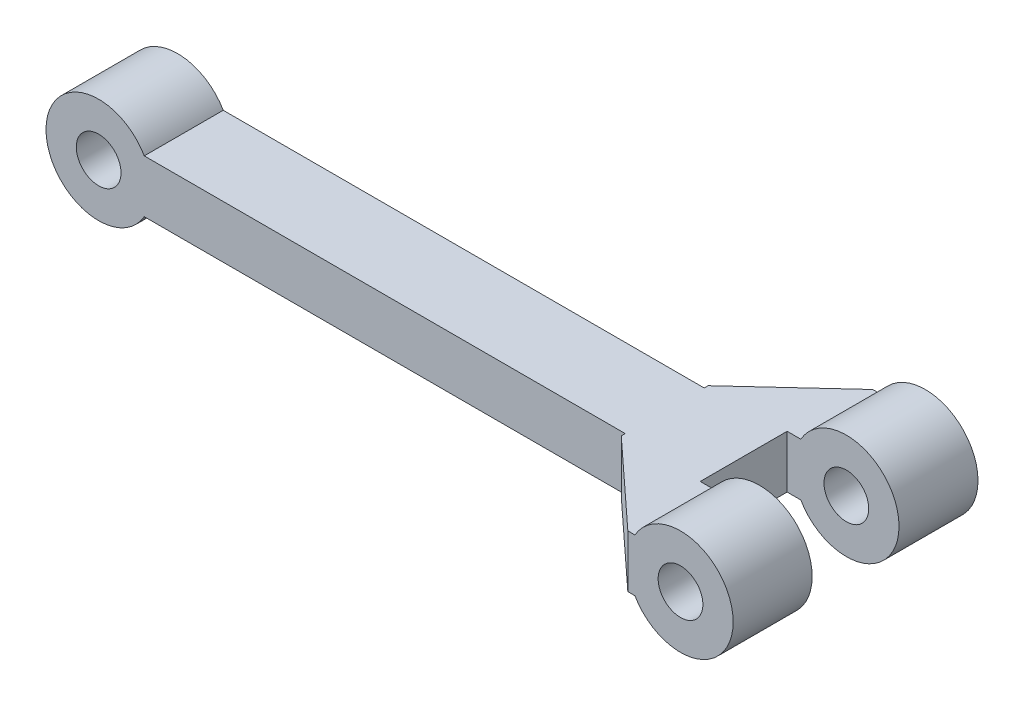
ISO-10303-21;
HEADER;
FILE_DESCRIPTION(('STEP AP214'),'2;1');
FILE_NAME('part.step','',(''),(''),'','','');
FILE_SCHEMA(('AUTOMOTIVE_DESIGN { 1 0 10303 214 1 1 1 1 }'));
ENDSEC;
DATA;
#1=APPLICATION_CONTEXT('core data for automotive mechanical design processes');
#2=APPLICATION_PROTOCOL_DEFINITION('international standard','automotive_design',2000,#1);
#3=PRODUCT_CONTEXT('',#1,'mechanical');
#4=PRODUCT('Part','Part','',(#3));
#5=PRODUCT_RELATED_PRODUCT_CATEGORY('part','',(#4));
#6=PRODUCT_DEFINITION_FORMATION('','',#4);
#7=PRODUCT_DEFINITION_CONTEXT('part definition',#1,'design');
#8=PRODUCT_DEFINITION('design','',#6,#7);
#9=PRODUCT_DEFINITION_SHAPE('','',#8);
#10=(LENGTH_UNIT() NAMED_UNIT(*) SI_UNIT(.MILLI.,.METRE.));
#11=(NAMED_UNIT(*) PLANE_ANGLE_UNIT() SI_UNIT($,.RADIAN.));
#12=(NAMED_UNIT(*) SI_UNIT($,.STERADIAN.) SOLID_ANGLE_UNIT());
#13=UNCERTAINTY_MEASURE_WITH_UNIT(LENGTH_MEASURE(1.E-05),#10,'distance_accuracy_value','');
#14=(GEOMETRIC_REPRESENTATION_CONTEXT(3) GLOBAL_UNCERTAINTY_ASSIGNED_CONTEXT((#13)) GLOBAL_UNIT_ASSIGNED_CONTEXT((#10,
#11,#12)) REPRESENTATION_CONTEXT('',''));
#15=CARTESIAN_POINT('',(0.,0.,0.));
#16=DIRECTION('',(0.,0.,1.));
#17=DIRECTION('',(1.,0.,0.));
#18=AXIS2_PLACEMENT_3D('',#15,#16,#17);
#19=CARTESIAN_POINT('',(-10.5,-2.,6.));
#20=DIRECTION('',(-1.,0.,0.));
#21=DIRECTION('',(0.,0.,1.));
#22=AXIS2_PLACEMENT_3D('',#19,#20,#21);
#23=PLANE('',#22);
#24=DIRECTION('',(0.,0.,1.));
#25=VECTOR('',#24,1.);
#26=CARTESIAN_POINT('',(-10.5,2.,6.));
#27=LINE('',#26,#25);
#28=CARTESIAN_POINT('',(-10.5,2.,12.3));
#29=VERTEX_POINT('',#28);
#30=CARTESIAN_POINT('',(-10.5,2.,12.6));
#31=VERTEX_POINT('',#30);
#32=EDGE_CURVE('E260',#29,#31,#27,.T.);
#33=ORIENTED_EDGE('',*,*,#32,.F.);
#34=DIRECTION('',(0.,-1.,0.));
#35=VECTOR('',#34,1.);
#36=CARTESIAN_POINT('',(-10.5,2.,12.3));
#37=LINE('',#36,#35);
#38=CARTESIAN_POINT('',(-10.5,-2.,12.3));
#39=VERTEX_POINT('',#38);
#40=EDGE_CURVE('E326',#29,#39,#37,.T.);
#41=ORIENTED_EDGE('',*,*,#40,.T.);
#42=DIRECTION('',(0.,0.,1.));
#43=VECTOR('',#42,1.);
#44=CARTESIAN_POINT('',(-10.5,-2.,6.));
#45=LINE('',#44,#43);
#46=CARTESIAN_POINT('',(-10.5,-2.,12.6));
#47=VERTEX_POINT('',#46);
#48=EDGE_CURVE('E177',#39,#47,#45,.T.);
#49=ORIENTED_EDGE('',*,*,#48,.T.);
#50=DIRECTION('',(0.,1.,0.));
#51=VECTOR('',#50,1.);
#52=CARTESIAN_POINT('',(-10.5,-2.,12.6));
#53=LINE('',#52,#51);
#54=EDGE_CURVE('E214',#47,#31,#53,.T.);
#55=ORIENTED_EDGE('',*,*,#54,.T.);
#56=EDGE_LOOP('',(#33,#41,#49,#55));
#57=FACE_BOUND('',#56,.T.);
#58=ADVANCED_FACE('F45',(#57),#23,.T.);
#59=CARTESIAN_POINT('',(0.,0.,6.));
#60=DIRECTION('',(0.,0.,1.));
#61=DIRECTION('',(1.,0.,0.));
#62=AXIS2_PLACEMENT_3D('',#59,#60,#61);
#63=PLANE('',#62);
#64=DIRECTION('',(1.,0.,0.));
#65=VECTOR('',#64,1.);
#66=CARTESIAN_POINT('',(-4.5,-2.,6.));
#67=LINE('',#66,#65);
#68=CARTESIAN_POINT('',(-4.5,-2.,6.));
#69=VERTEX_POINT('',#68);
#70=CARTESIAN_POINT('',(-3.46410161513775,-2.,6.));
#71=VERTEX_POINT('',#70);
#72=EDGE_CURVE('E198',#69,#71,#67,.T.);
#73=ORIENTED_EDGE('',*,*,#72,.T.);
#74=CARTESIAN_POINT('',(0.,0.,6.));
#75=DIRECTION('',(0.,0.,1.));
#76=DIRECTION('',(1.,0.,0.));
#77=AXIS2_PLACEMENT_3D('',#74,#75,#76);
#78=CIRCLE('',#77,4.);
#79=CARTESIAN_POINT('',(-3.46410161513775,2.,6.));
#80=VERTEX_POINT('',#79);
#81=EDGE_CURVE('E230',#71,#80,#78,.T.);
#82=ORIENTED_EDGE('',*,*,#81,.T.);
#83=DIRECTION('',(1.,0.,0.));
#84=VECTOR('',#83,1.);
#85=CARTESIAN_POINT('',(-4.5,2.,6.));
#86=LINE('',#85,#84);
#87=CARTESIAN_POINT('',(-4.5,2.,6.));
#88=VERTEX_POINT('',#87);
#89=EDGE_CURVE('E248',#88,#80,#86,.T.);
#90=ORIENTED_EDGE('',*,*,#89,.F.);
#91=DIRECTION('',(0.,1.,0.));
#92=VECTOR('',#91,1.);
#93=CARTESIAN_POINT('',(-4.5,-2.,6.));
#94=LINE('',#93,#92);
#95=EDGE_CURVE('E203',#69,#88,#94,.T.);
#96=ORIENTED_EDGE('',*,*,#95,.F.);
#97=EDGE_LOOP('',(#73,#82,#90,#96));
#98=FACE_BOUND('',#97,.T.);
#99=CARTESIAN_POINT('',(0.,0.,6.));
#100=DIRECTION('',(0.,0.,1.));
#101=DIRECTION('',(1.,0.,0.));
#102=AXIS2_PLACEMENT_3D('',#99,#100,#101);
#103=CIRCLE('',#102,1.7);
#104=CARTESIAN_POINT('',(1.7,0.,6.));
#105=VERTEX_POINT('',#104);
#106=EDGE_CURVE('E222',#105,#105,#103,.T.);
#107=ORIENTED_EDGE('',*,*,#106,.F.);
#108=EDGE_LOOP('',(#107));
#109=FACE_BOUND('',#108,.T.);
#110=ADVANCED_FACE('F291',(#98,#109),#63,.T.);
#111=CARTESIAN_POINT('',(0.,0.,0.));
#112=DIRECTION('',(0.,0.,1.));
#113=DIRECTION('',(1.,0.,0.));
#114=AXIS2_PLACEMENT_3D('',#111,#112,#113);
#115=PLANE('',#114);
#116=CARTESIAN_POINT('',(0.,0.,0.));
#117=DIRECTION('',(0.,0.,1.));
#118=DIRECTION('',(1.,0.,0.));
#119=AXIS2_PLACEMENT_3D('',#116,#117,#118);
#120=CIRCLE('',#119,4.);
#121=CARTESIAN_POINT('',(-3.46410161513775,-2.,0.));
#122=VERTEX_POINT('',#121);
#123=CARTESIAN_POINT('',(-3.46410161513775,2.,0.));
#124=VERTEX_POINT('',#123);
#125=EDGE_CURVE('E226',#122,#124,#120,.T.);
#126=ORIENTED_EDGE('',*,*,#125,.F.);
#127=DIRECTION('',(-1.,0.,0.));
#128=VECTOR('',#127,1.);
#129=CARTESIAN_POINT('',(-4.,-2.,0.));
#130=LINE('',#129,#128);
#131=CARTESIAN_POINT('',(-4.,-2.,0.));
#132=VERTEX_POINT('',#131);
#133=EDGE_CURVE('E283',#122,#132,#130,.T.);
#134=ORIENTED_EDGE('',*,*,#133,.T.);
#135=DIRECTION('',(0.,1.,0.));
#136=VECTOR('',#135,1.);
#137=CARTESIAN_POINT('',(-4.,-2.,0.));
#138=LINE('',#137,#136);
#139=CARTESIAN_POINT('',(-4.,2.,0.));
#140=VERTEX_POINT('',#139);
#141=EDGE_CURVE('E202',#132,#140,#138,.T.);
#142=ORIENTED_EDGE('',*,*,#141,.T.);
#143=DIRECTION('',(-1.,0.,0.));
#144=VECTOR('',#143,1.);
#145=CARTESIAN_POINT('',(-4.,2.,0.));
#146=LINE('',#145,#144);
#147=EDGE_CURVE('E244',#124,#140,#146,.T.);
#148=ORIENTED_EDGE('',*,*,#147,.F.);
#149=EDGE_LOOP('',(#126,#134,#142,#148));
#150=FACE_BOUND('',#149,.T.);
#151=CARTESIAN_POINT('',(0.,0.,0.));
#152=DIRECTION('',(0.,0.,1.));
#153=DIRECTION('',(1.,0.,0.));
#154=AXIS2_PLACEMENT_3D('',#151,#152,#153);
#155=CIRCLE('',#154,1.7);
#156=CARTESIAN_POINT('',(1.7,0.,0.));
#157=VERTEX_POINT('',#156);
#158=EDGE_CURVE('E206',#157,#157,#155,.T.);
#159=ORIENTED_EDGE('',*,*,#158,.T.);
#160=EDGE_LOOP('',(#159));
#161=FACE_BOUND('',#160,.T.);
#162=ADVANCED_FACE('F250',(#150,#161),#115,.F.);
#163=CARTESIAN_POINT('',(0.,0.,6.));
#164=DIRECTION('',(0.,0.,-1.));
#165=DIRECTION('',(-1.,0.,0.));
#166=AXIS2_PLACEMENT_3D('',#163,#164,#165);
#167=CYLINDRICAL_SURFACE('',#166,4.);
#168=ORIENTED_EDGE('',*,*,#81,.F.);
#169=DIRECTION('',(0.,0.,-1.));
#170=VECTOR('',#169,1.);
#171=CARTESIAN_POINT('',(-3.46410161513775,-2.,6.));
#172=LINE('',#171,#170);
#173=EDGE_CURVE('E11',#71,#122,#172,.T.);
#174=ORIENTED_EDGE('',*,*,#173,.T.);
#175=ORIENTED_EDGE('',*,*,#125,.T.);
#176=DIRECTION('',(0.,0.,-1.));
#177=VECTOR('',#176,1.);
#178=CARTESIAN_POINT('',(-3.46410161513775,2.,6.));
#179=LINE('',#178,#177);
#180=EDGE_CURVE('E54',#80,#124,#179,.T.);
#181=ORIENTED_EDGE('',*,*,#180,.F.);
#182=EDGE_LOOP('',(#168,#174,#175,#181));
#183=FACE_BOUND('',#182,.T.);
#184=ADVANCED_FACE('F47',(#183),#167,.T.);
#185=CARTESIAN_POINT('',(0.,0.,6.));
#186=DIRECTION('',(0.,0.,-1.));
#187=DIRECTION('',(-1.,0.,0.));
#188=AXIS2_PLACEMENT_3D('',#185,#186,#187);
#189=CYLINDRICAL_SURFACE('',#188,1.7);
#190=ORIENTED_EDGE('',*,*,#106,.T.);
#191=EDGE_LOOP('',(#190));
#192=FACE_BOUND('',#191,.T.);
#193=ORIENTED_EDGE('',*,*,#158,.F.);
#194=EDGE_LOOP('',(#193));
#195=FACE_BOUND('',#194,.T.);
#196=ADVANCED_FACE('F392',(#192,#195),#189,.F.);
#197=CARTESIAN_POINT('',(0.,-2.,0.));
#198=DIRECTION('',(0.,-1.,0.));
#199=DIRECTION('',(0.,0.,-1.));
#200=AXIS2_PLACEMENT_3D('',#197,#198,#199);
#201=PLANE('',#200);
#202=DIRECTION('',(0.,0.,1.));
#203=VECTOR('',#202,1.);
#204=CARTESIAN_POINT('',(-3.46410161513775,-2.,12.6));
#205=LINE('',#204,#203);
#206=CARTESIAN_POINT('',(-3.46410161513775,-2.,18.6));
#207=VERTEX_POINT('',#206);
#208=CARTESIAN_POINT('',(-3.46410161513775,-2.,12.6));
#209=VERTEX_POINT('',#208);
#210=EDGE_CURVE('E256',#207,#209,#205,.F.);
#211=ORIENTED_EDGE('',*,*,#210,.F.);
#212=DIRECTION('',(1.,0.,0.));
#213=VECTOR('',#212,1.);
#214=CARTESIAN_POINT('',(-3.,-2.,18.6));
#215=LINE('',#214,#213);
#216=CARTESIAN_POINT('',(-4.,-2.,18.6));
#217=VERTEX_POINT('',#216);
#218=EDGE_CURVE('E182',#217,#207,#215,.T.);
#219=ORIENTED_EDGE('',*,*,#218,.F.);
#220=DIRECTION('',(0.734803444627488,0.,0.678280102733065));
#221=VECTOR('',#220,1.);
#222=CARTESIAN_POINT('',(-10.5,-2.,12.6));
#223=LINE('',#222,#221);
#224=EDGE_CURVE('E176',#47,#217,#223,.T.);
#225=ORIENTED_EDGE('',*,*,#224,.F.);
#226=ORIENTED_EDGE('',*,*,#48,.F.);
#227=DIRECTION('',(-1.,0.,0.));
#228=VECTOR('',#227,1.);
#229=CARTESIAN_POINT('',(-10.5,-2.,12.3));
#230=LINE('',#229,#228);
#231=CARTESIAN_POINT('',(-47.0358983848622,-2.,12.3));
#232=VERTEX_POINT('',#231);
#233=EDGE_CURVE('E61',#39,#232,#230,.T.);
#234=ORIENTED_EDGE('',*,*,#233,.T.);
#235=DIRECTION('',(0.,0.,-1.));
#236=VECTOR('',#235,1.);
#237=CARTESIAN_POINT('',(-47.0358983848622,-2.,12.3));
#238=LINE('',#237,#236);
#239=CARTESIAN_POINT('',(-47.0358983848622,-2.,6.3));
#240=VERTEX_POINT('',#239);
#241=EDGE_CURVE('E154',#232,#240,#238,.T.);
#242=ORIENTED_EDGE('',*,*,#241,.T.);
#243=DIRECTION('',(-1.,0.,0.));
#244=VECTOR('',#243,1.);
#245=CARTESIAN_POINT('',(-10.5,-2.,6.3));
#246=LINE('',#245,#244);
#247=CARTESIAN_POINT('',(-10.5,-2.,6.3));
#248=VERTEX_POINT('',#247);
#249=EDGE_CURVE('E146',#248,#240,#246,.T.);
#250=ORIENTED_EDGE('',*,*,#249,.F.);
#251=CARTESIAN_POINT('',(-10.5,-2.,6.));
#252=VERTEX_POINT('',#251);
#253=EDGE_CURVE('E152',#252,#248,#45,.T.);
#254=ORIENTED_EDGE('',*,*,#253,.F.);
#255=DIRECTION('',(-0.734803444627488,0.,0.678280102733066));
#256=VECTOR('',#255,1.);
#257=CARTESIAN_POINT('',(-4.,-2.,0.));
#258=LINE('',#257,#256);
#259=EDGE_CURVE('E184',#132,#252,#258,.T.);
#260=ORIENTED_EDGE('',*,*,#259,.F.);
#261=ORIENTED_EDGE('',*,*,#133,.F.);
#262=ORIENTED_EDGE('',*,*,#173,.F.);
#263=ORIENTED_EDGE('',*,*,#72,.F.);
#264=DIRECTION('',(0.,0.,-1.));
#265=VECTOR('',#264,1.);
#266=CARTESIAN_POINT('',(-4.5,-2.,12.6));
#267=LINE('',#266,#265);
#268=CARTESIAN_POINT('',(-4.5,-2.,12.6));
#269=VERTEX_POINT('',#268);
#270=EDGE_CURVE('E194',#269,#69,#267,.T.);
#271=ORIENTED_EDGE('',*,*,#270,.F.);
#272=DIRECTION('',(-1.,0.,0.));
#273=VECTOR('',#272,1.);
#274=CARTESIAN_POINT('',(-4.,-2.,12.6));
#275=LINE('',#274,#273);
#276=EDGE_CURVE('E191',#209,#269,#275,.T.);
#277=ORIENTED_EDGE('',*,*,#276,.F.);
#278=EDGE_LOOP('',(#211,#219,#225,#226,#234,#242,#250,#254,#260,#261,#262,#263,#271,#277));
#279=FACE_BOUND('',#278,.T.);
#280=ADVANCED_FACE('F149',(#279),#201,.T.);
#281=CARTESIAN_POINT('',(0.,2.,0.));
#282=DIRECTION('',(0.,-1.,0.));
#283=DIRECTION('',(0.,0.,-1.));
#284=AXIS2_PLACEMENT_3D('',#281,#282,#283);
#285=PLANE('',#284);
#286=DIRECTION('',(1.,0.,0.));
#287=VECTOR('',#286,1.);
#288=CARTESIAN_POINT('',(-3.,2.,18.6));
#289=LINE('',#288,#287);
#290=CARTESIAN_POINT('',(-4.,2.,18.6));
#291=VERTEX_POINT('',#290);
#292=CARTESIAN_POINT('',(-3.46410161513775,2.,18.6));
#293=VERTEX_POINT('',#292);
#294=EDGE_CURVE('E273',#291,#293,#289,.T.);
#295=ORIENTED_EDGE('',*,*,#294,.T.);
#296=DIRECTION('',(0.,0.,1.));
#297=VECTOR('',#296,1.);
#298=CARTESIAN_POINT('',(-3.46410161513775,2.,12.6));
#299=LINE('',#298,#297);
#300=CARTESIAN_POINT('',(-3.46410161513775,2.,12.6));
#301=VERTEX_POINT('',#300);
#302=EDGE_CURVE('E262',#293,#301,#299,.F.);
#303=ORIENTED_EDGE('',*,*,#302,.T.);
#304=DIRECTION('',(-1.,0.,0.));
#305=VECTOR('',#304,1.);
#306=CARTESIAN_POINT('',(-4.,2.,12.6));
#307=LINE('',#306,#305);
#308=CARTESIAN_POINT('',(-4.5,2.,12.6));
#309=VERTEX_POINT('',#308);
#310=EDGE_CURVE('E276',#301,#309,#307,.T.);
#311=ORIENTED_EDGE('',*,*,#310,.T.);
#312=DIRECTION('',(0.,0.,-1.));
#313=VECTOR('',#312,1.);
#314=CARTESIAN_POINT('',(-4.5,2.,12.6));
#315=LINE('',#314,#313);
#316=EDGE_CURVE('E279',#309,#88,#315,.T.);
#317=ORIENTED_EDGE('',*,*,#316,.T.);
#318=ORIENTED_EDGE('',*,*,#89,.T.);
#319=ORIENTED_EDGE('',*,*,#180,.T.);
#320=ORIENTED_EDGE('',*,*,#147,.T.);
#321=DIRECTION('',(-0.734803444627488,0.,0.678280102733066));
#322=VECTOR('',#321,1.);
#323=CARTESIAN_POINT('',(-4.,2.,0.));
#324=LINE('',#323,#322);
#325=CARTESIAN_POINT('',(-10.5,2.,6.));
#326=VERTEX_POINT('',#325);
#327=EDGE_CURVE('E255',#140,#326,#324,.T.);
#328=ORIENTED_EDGE('',*,*,#327,.T.);
#329=CARTESIAN_POINT('',(-10.5,2.,6.3));
#330=VERTEX_POINT('',#329);
#331=EDGE_CURVE('E266',#326,#330,#27,.T.);
#332=ORIENTED_EDGE('',*,*,#331,.T.);
#333=DIRECTION('',(1.,0.,0.));
#334=VECTOR('',#333,1.);
#335=CARTESIAN_POINT('',(-10.5,2.,6.3));
#336=LINE('',#335,#334);
#337=CARTESIAN_POINT('',(-47.0358983848622,2.,6.3));
#338=VERTEX_POINT('',#337);
#339=EDGE_CURVE('E166',#338,#330,#336,.T.);
#340=ORIENTED_EDGE('',*,*,#339,.F.);
#341=DIRECTION('',(0.,0.,-1.));
#342=VECTOR('',#341,1.);
#343=CARTESIAN_POINT('',(-47.0358983848622,2.,12.3));
#344=LINE('',#343,#342);
#345=CARTESIAN_POINT('',(-47.0358983848622,2.,12.3));
#346=VERTEX_POINT('',#345);
#347=EDGE_CURVE('E338',#346,#338,#344,.T.);
#348=ORIENTED_EDGE('',*,*,#347,.F.);
#349=DIRECTION('',(1.,0.,0.));
#350=VECTOR('',#349,1.);
#351=CARTESIAN_POINT('',(-10.5,2.,12.3));
#352=LINE('',#351,#350);
#353=EDGE_CURVE('E320',#346,#29,#352,.T.);
#354=ORIENTED_EDGE('',*,*,#353,.T.);
#355=ORIENTED_EDGE('',*,*,#32,.T.);
#356=DIRECTION('',(0.734803444627488,0.,0.678280102733065));
#357=VECTOR('',#356,1.);
#358=CARTESIAN_POINT('',(-10.5,2.,12.6));
#359=LINE('',#358,#357);
#360=EDGE_CURVE('E269',#31,#291,#359,.T.);
#361=ORIENTED_EDGE('',*,*,#360,.T.);
#362=EDGE_LOOP('',(#295,#303,#311,#317,#318,#319,#320,#328,#332,#340,#348,#354,#355,#361));
#363=FACE_BOUND('',#362,.T.);
#364=ADVANCED_FACE('F242',(#363),#285,.F.);
#365=CARTESIAN_POINT('',(-4.5,-2.,12.6));
#366=DIRECTION('',(1.,0.,0.));
#367=DIRECTION('',(0.,0.,-1.));
#368=AXIS2_PLACEMENT_3D('',#365,#366,#367);
#369=PLANE('',#368);
#370=ORIENTED_EDGE('',*,*,#95,.T.);
#371=ORIENTED_EDGE('',*,*,#316,.F.);
#372=DIRECTION('',(0.,1.,0.));
#373=VECTOR('',#372,1.);
#374=CARTESIAN_POINT('',(-4.5,-2.,12.6));
#375=LINE('',#374,#373);
#376=EDGE_CURVE('E207',#269,#309,#375,.T.);
#377=ORIENTED_EDGE('',*,*,#376,.F.);
#378=ORIENTED_EDGE('',*,*,#270,.T.);
#379=EDGE_LOOP('',(#370,#371,#377,#378));
#380=FACE_BOUND('',#379,.T.);
#381=ADVANCED_FACE('F295',(#380),#369,.T.);
#382=CARTESIAN_POINT('',(-4.,-2.,12.6));
#383=DIRECTION('',(0.,0.,-1.));
#384=DIRECTION('',(-1.,0.,0.));
#385=AXIS2_PLACEMENT_3D('',#382,#383,#384);
#386=PLANE('',#385);
#387=CARTESIAN_POINT('',(0.,0.,12.6));
#388=DIRECTION('',(0.,0.,1.));
#389=DIRECTION('',(1.,0.,0.));
#390=AXIS2_PLACEMENT_3D('',#387,#388,#389);
#391=CIRCLE('',#390,4.);
#392=EDGE_CURVE('E351',#209,#301,#391,.T.);
#393=ORIENTED_EDGE('',*,*,#392,.F.);
#394=ORIENTED_EDGE('',*,*,#276,.T.);
#395=ORIENTED_EDGE('',*,*,#376,.T.);
#396=ORIENTED_EDGE('',*,*,#310,.F.);
#397=EDGE_LOOP('',(#393,#394,#395,#396));
#398=FACE_BOUND('',#397,.T.);
#399=CARTESIAN_POINT('',(0.,0.,12.6));
#400=DIRECTION('',(0.,0.,1.));
#401=DIRECTION('',(1.,0.,0.));
#402=AXIS2_PLACEMENT_3D('',#399,#400,#401);
#403=CIRCLE('',#402,1.7);
#404=CARTESIAN_POINT('',(1.7,0.,12.6));
#405=VERTEX_POINT('',#404);
#406=EDGE_CURVE('E344',#405,#405,#403,.T.);
#407=ORIENTED_EDGE('',*,*,#406,.T.);
#408=EDGE_LOOP('',(#407));
#409=FACE_BOUND('',#408,.T.);
#410=ADVANCED_FACE('F301',(#398,#409),#386,.T.);
#411=CARTESIAN_POINT('',(-3.,-2.,18.6));
#412=DIRECTION('',(0.,0.,1.));
#413=DIRECTION('',(1.,0.,0.));
#414=AXIS2_PLACEMENT_3D('',#411,#412,#413);
#415=PLANE('',#414);
#416=ORIENTED_EDGE('',*,*,#218,.T.);
#417=CARTESIAN_POINT('',(0.,0.,18.6));
#418=DIRECTION('',(0.,0.,1.));
#419=DIRECTION('',(1.,0.,0.));
#420=AXIS2_PLACEMENT_3D('',#417,#418,#419);
#421=CIRCLE('',#420,4.);
#422=EDGE_CURVE('E312',#207,#293,#421,.T.);
#423=ORIENTED_EDGE('',*,*,#422,.T.);
#424=ORIENTED_EDGE('',*,*,#294,.F.);
#425=DIRECTION('',(0.,1.,0.));
#426=VECTOR('',#425,1.);
#427=CARTESIAN_POINT('',(-4.,-2.,18.6));
#428=LINE('',#427,#426);
#429=EDGE_CURVE('E211',#217,#291,#428,.T.);
#430=ORIENTED_EDGE('',*,*,#429,.F.);
#431=EDGE_LOOP('',(#416,#423,#424,#430));
#432=FACE_BOUND('',#431,.T.);
#433=CARTESIAN_POINT('',(0.,0.,18.6));
#434=DIRECTION('',(0.,0.,1.));
#435=DIRECTION('',(1.,0.,0.));
#436=AXIS2_PLACEMENT_3D('',#433,#434,#435);
#437=CIRCLE('',#436,1.7);
#438=CARTESIAN_POINT('',(1.7,0.,18.6));
#439=VERTEX_POINT('',#438);
#440=EDGE_CURVE('E341',#439,#439,#437,.T.);
#441=ORIENTED_EDGE('',*,*,#440,.F.);
#442=EDGE_LOOP('',(#441));
#443=FACE_BOUND('',#442,.T.);
#444=ADVANCED_FACE('F309',(#432,#443),#415,.T.);
#445=CARTESIAN_POINT('',(-10.5,-2.,12.6));
#446=DIRECTION('',(-0.678280102733065,0.,0.734803444627488));
#447=DIRECTION('',(0.734803444627488,0.,0.678280102733065));
#448=AXIS2_PLACEMENT_3D('',#445,#446,#447);
#449=PLANE('',#448);
#450=ORIENTED_EDGE('',*,*,#429,.T.);
#451=ORIENTED_EDGE('',*,*,#360,.F.);
#452=ORIENTED_EDGE('',*,*,#54,.F.);
#453=ORIENTED_EDGE('',*,*,#224,.T.);
#454=EDGE_LOOP('',(#450,#451,#452,#453));
#455=FACE_BOUND('',#454,.T.);
#456=ADVANCED_FACE('F315',(#455),#449,.T.);
#457=DIRECTION('',(0.,-1.,0.));
#458=VECTOR('',#457,1.);
#459=CARTESIAN_POINT('',(-10.5,2.,6.3));
#460=LINE('',#459,#458);
#461=EDGE_CURVE('E160',#330,#248,#460,.T.);
#462=ORIENTED_EDGE('',*,*,#461,.F.);
#463=ORIENTED_EDGE('',*,*,#331,.F.);
#464=DIRECTION('',(0.,1.,0.));
#465=VECTOR('',#464,1.);
#466=CARTESIAN_POINT('',(-10.5,-2.,6.));
#467=LINE('',#466,#465);
#468=EDGE_CURVE('E174',#252,#326,#467,.T.);
#469=ORIENTED_EDGE('',*,*,#468,.F.);
#470=ORIENTED_EDGE('',*,*,#253,.T.);
#471=EDGE_LOOP('',(#462,#463,#469,#470));
#472=FACE_BOUND('',#471,.T.);
#473=ADVANCED_FACE('F173',(#472),#23,.T.);
#474=CARTESIAN_POINT('',(-4.,-2.,0.));
#475=DIRECTION('',(-0.678280102733066,0.,-0.734803444627488));
#476=DIRECTION('',(-0.734803444627488,0.,0.678280102733066));
#477=AXIS2_PLACEMENT_3D('',#474,#475,#476);
#478=PLANE('',#477);
#479=ORIENTED_EDGE('',*,*,#468,.T.);
#480=ORIENTED_EDGE('',*,*,#327,.F.);
#481=ORIENTED_EDGE('',*,*,#141,.F.);
#482=ORIENTED_EDGE('',*,*,#259,.T.);
#483=EDGE_LOOP('',(#479,#480,#481,#482));
#484=FACE_BOUND('',#483,.T.);
#485=ADVANCED_FACE('F287',(#484),#478,.T.);
#486=CARTESIAN_POINT('',(0.,0.,12.6));
#487=DIRECTION('',(0.,0.,1.));
#488=DIRECTION('',(1.,0.,0.));
#489=AXIS2_PLACEMENT_3D('',#486,#487,#488);
#490=CYLINDRICAL_SURFACE('',#489,4.);
#491=ORIENTED_EDGE('',*,*,#422,.F.);
#492=ORIENTED_EDGE('',*,*,#210,.T.);
#493=ORIENTED_EDGE('',*,*,#392,.T.);
#494=ORIENTED_EDGE('',*,*,#302,.F.);
#495=EDGE_LOOP('',(#491,#492,#493,#494));
#496=FACE_BOUND('',#495,.T.);
#497=ADVANCED_FACE('F356',(#496),#490,.T.);
#498=CARTESIAN_POINT('',(0.,0.,12.6));
#499=DIRECTION('',(0.,0.,1.));
#500=DIRECTION('',(1.,0.,0.));
#501=AXIS2_PLACEMENT_3D('',#498,#499,#500);
#502=CYLINDRICAL_SURFACE('',#501,1.7);
#503=ORIENTED_EDGE('',*,*,#406,.F.);
#504=EDGE_LOOP('',(#503));
#505=FACE_BOUND('',#504,.T.);
#506=ORIENTED_EDGE('',*,*,#440,.T.);
#507=EDGE_LOOP('',(#506));
#508=FACE_BOUND('',#507,.T.);
#509=ADVANCED_FACE('F358',(#505,#508),#502,.F.);
#510=CARTESIAN_POINT('',(-50.5,0.,12.3));
#511=DIRECTION('',(0.,0.,-1.));
#512=DIRECTION('',(-1.,0.,0.));
#513=AXIS2_PLACEMENT_3D('',#510,#511,#512);
#514=CYLINDRICAL_SURFACE('',#513,4.);
#515=ORIENTED_EDGE('',*,*,#347,.T.);
#516=CARTESIAN_POINT('',(-50.5,0.,6.3));
#517=DIRECTION('',(0.,0.,-1.));
#518=DIRECTION('',(-1.,0.,0.));
#519=AXIS2_PLACEMENT_3D('',#516,#517,#518);
#520=CIRCLE('',#519,4.);
#521=EDGE_CURVE('E159',#240,#338,#520,.T.);
#522=ORIENTED_EDGE('',*,*,#521,.F.);
#523=ORIENTED_EDGE('',*,*,#241,.F.);
#524=CARTESIAN_POINT('',(-50.5,0.,12.3));
#525=DIRECTION('',(0.,0.,-1.));
#526=DIRECTION('',(-1.,0.,0.));
#527=AXIS2_PLACEMENT_3D('',#524,#525,#526);
#528=CIRCLE('',#527,4.);
#529=EDGE_CURVE('E325',#232,#346,#528,.T.);
#530=ORIENTED_EDGE('',*,*,#529,.T.);
#531=EDGE_LOOP('',(#515,#522,#523,#530));
#532=FACE_BOUND('',#531,.T.);
#533=ADVANCED_FACE('F364',(#532),#514,.T.);
#534=CARTESIAN_POINT('',(-50.5,0.,12.3));
#535=DIRECTION('',(0.,0.,-1.));
#536=DIRECTION('',(-1.,0.,0.));
#537=AXIS2_PLACEMENT_3D('',#534,#535,#536);
#538=PLANE('',#537);
#539=CARTESIAN_POINT('',(-50.5,0.,12.3));
#540=DIRECTION('',(0.,0.,-1.));
#541=DIRECTION('',(-1.,0.,0.));
#542=AXIS2_PLACEMENT_3D('',#539,#540,#541);
#543=CIRCLE('',#542,1.7);
#544=CARTESIAN_POINT('',(-52.2,0.,12.3));
#545=VERTEX_POINT('',#544);
#546=EDGE_CURVE('E332',#545,#545,#543,.T.);
#547=ORIENTED_EDGE('',*,*,#546,.T.);
#548=EDGE_LOOP('',(#547));
#549=FACE_BOUND('',#548,.T.);
#550=ORIENTED_EDGE('',*,*,#40,.F.);
#551=ORIENTED_EDGE('',*,*,#353,.F.);
#552=ORIENTED_EDGE('',*,*,#529,.F.);
#553=ORIENTED_EDGE('',*,*,#233,.F.);
#554=EDGE_LOOP('',(#550,#551,#552,#553));
#555=FACE_BOUND('',#554,.T.);
#556=ADVANCED_FACE('F511',(#549,#555),#538,.F.);
#557=CARTESIAN_POINT('',(-50.5,0.,12.3));
#558=DIRECTION('',(0.,0.,-1.));
#559=DIRECTION('',(-1.,0.,0.));
#560=AXIS2_PLACEMENT_3D('',#557,#558,#559);
#561=CYLINDRICAL_SURFACE('',#560,1.7);
#562=ORIENTED_EDGE('',*,*,#546,.F.);
#563=EDGE_LOOP('',(#562));
#564=FACE_BOUND('',#563,.T.);
#565=CARTESIAN_POINT('',(-50.5,0.,6.3));
#566=DIRECTION('',(0.,0.,-1.));
#567=DIRECTION('',(-1.,0.,0.));
#568=AXIS2_PLACEMENT_3D('',#565,#566,#567);
#569=CIRCLE('',#568,1.7);
#570=CARTESIAN_POINT('',(-52.2,0.,6.3));
#571=VERTEX_POINT('',#570);
#572=EDGE_CURVE('E171',#571,#571,#569,.T.);
#573=ORIENTED_EDGE('',*,*,#572,.T.);
#574=EDGE_LOOP('',(#573));
#575=FACE_BOUND('',#574,.T.);
#576=ADVANCED_FACE('F520',(#564,#575),#561,.F.);
#577=CARTESIAN_POINT('',(-50.5,0.,6.3));
#578=DIRECTION('',(0.,0.,-1.));
#579=DIRECTION('',(-1.,0.,0.));
#580=AXIS2_PLACEMENT_3D('',#577,#578,#579);
#581=PLANE('',#580);
#582=ORIENTED_EDGE('',*,*,#461,.T.);
#583=ORIENTED_EDGE('',*,*,#249,.T.);
#584=ORIENTED_EDGE('',*,*,#521,.T.);
#585=ORIENTED_EDGE('',*,*,#339,.T.);
#586=EDGE_LOOP('',(#582,#583,#584,#585));
#587=FACE_BOUND('',#586,.T.);
#588=ORIENTED_EDGE('',*,*,#572,.F.);
#589=EDGE_LOOP('',(#588));
#590=FACE_BOUND('',#589,.T.);
#591=ADVANCED_FACE('F163',(#587,#590),#581,.T.);
#592=CLOSED_SHELL('',(#58,#110,#162,#184,#196,#280,#364,#381,#410,#444,#456,#473,#485,#497,#509,
#533,#556,#576,#591));
#593=MANIFOLD_SOLID_BREP('B2',#592);
#594=ADVANCED_BREP_SHAPE_REPRESENTATION('',(#18,#593),#14);
#595=SHAPE_DEFINITION_REPRESENTATION(#9,#594);
ENDSEC;
END-ISO-10303-21;
